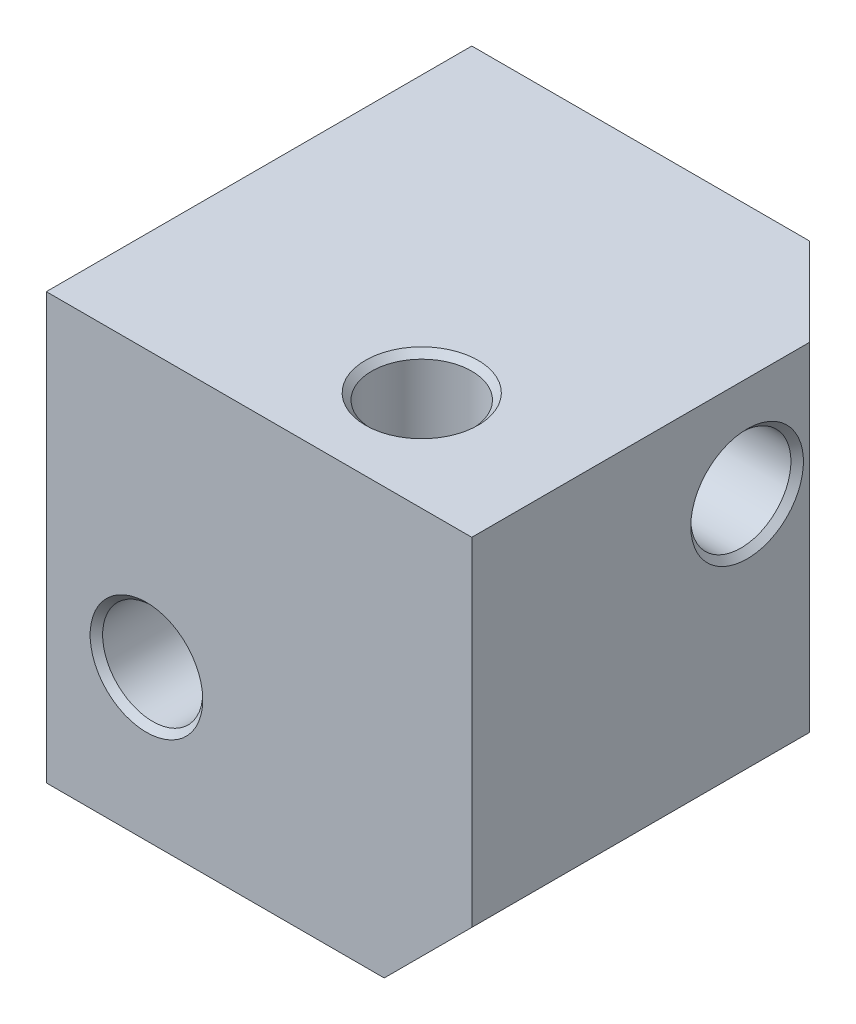
ISO-10303-21;
HEADER;
FILE_DESCRIPTION(('STEP AP214'),'2;1');
FILE_NAME('part.step','',(''),(''),'','','');
FILE_SCHEMA(('AUTOMOTIVE_DESIGN { 1 0 10303 214 1 1 1 1 }'));
ENDSEC;
DATA;
#1=APPLICATION_CONTEXT('core data for automotive mechanical design processes');
#2=APPLICATION_PROTOCOL_DEFINITION('international standard','automotive_design',2000,#1);
#3=PRODUCT_CONTEXT('',#1,'mechanical');
#4=PRODUCT('Part','Part','',(#3));
#5=PRODUCT_RELATED_PRODUCT_CATEGORY('part','',(#4));
#6=PRODUCT_DEFINITION_FORMATION('','',#4);
#7=PRODUCT_DEFINITION_CONTEXT('part definition',#1,'design');
#8=PRODUCT_DEFINITION('design','',#6,#7);
#9=PRODUCT_DEFINITION_SHAPE('','',#8);
#10=(LENGTH_UNIT() NAMED_UNIT(*) SI_UNIT(.MILLI.,.METRE.));
#11=(NAMED_UNIT(*) PLANE_ANGLE_UNIT() SI_UNIT($,.RADIAN.));
#12=(NAMED_UNIT(*) SI_UNIT($,.STERADIAN.) SOLID_ANGLE_UNIT());
#13=UNCERTAINTY_MEASURE_WITH_UNIT(LENGTH_MEASURE(1.E-05),#10,'distance_accuracy_value','');
#14=(GEOMETRIC_REPRESENTATION_CONTEXT(3) GLOBAL_UNCERTAINTY_ASSIGNED_CONTEXT((#13)) GLOBAL_UNIT_ASSIGNED_CONTEXT((#10,
#11,#12)) REPRESENTATION_CONTEXT('',''));
#15=CARTESIAN_POINT('',(0.,0.,0.));
#16=DIRECTION('',(0.,0.,1.));
#17=DIRECTION('',(1.,0.,0.));
#18=AXIS2_PLACEMENT_3D('',#15,#16,#17);
#19=CARTESIAN_POINT('',(0.,0.,17.));
#20=DIRECTION('',(1.,0.,0.));
#21=DIRECTION('',(0.,0.,-1.));
#22=AXIS2_PLACEMENT_3D('',#19,#20,#21);
#23=PLANE('',#22);
#24=CARTESIAN_POINT('',(0.,13.,6.00000000000001));
#25=DIRECTION('',(-1.,0.,0.));
#26=DIRECTION('',(0.,0.,1.));
#27=AXIS2_PLACEMENT_3D('',#24,#25,#26);
#28=CIRCLE('',#27,2.25);
#29=CARTESIAN_POINT('',(0.,13.,8.25000000000001));
#30=VERTEX_POINT('',#29);
#31=EDGE_CURVE('E165',#30,#30,#28,.T.);
#32=ORIENTED_EDGE('',*,*,#31,.F.);
#33=EDGE_LOOP('',(#32));
#34=FACE_BOUND('',#33,.T.);
#35=DIRECTION('',(0.,-1.,0.));
#36=VECTOR('',#35,1.);
#37=CARTESIAN_POINT('',(0.,0.,0.));
#38=LINE('',#37,#36);
#39=CARTESIAN_POINT('',(0.,17.,0.));
#40=VERTEX_POINT('',#39);
#41=CARTESIAN_POINT('',(0.,3.50000000000002,0.));
#42=VERTEX_POINT('',#41);
#43=EDGE_CURVE('E173',#40,#42,#38,.T.);
#44=ORIENTED_EDGE('',*,*,#43,.T.);
#45=DIRECTION('',(0.,-0.707106781186549,0.707106781186546));
#46=VECTOR('',#45,1.);
#47=CARTESIAN_POINT('',(0.,0.,3.5));
#48=LINE('',#47,#46);
#49=CARTESIAN_POINT('',(0.,0.,3.5));
#50=VERTEX_POINT('',#49);
#51=EDGE_CURVE('E11',#42,#50,#48,.T.);
#52=ORIENTED_EDGE('',*,*,#51,.T.);
#53=DIRECTION('',(0.,0.,-1.));
#54=VECTOR('',#53,1.);
#55=CARTESIAN_POINT('',(0.,0.,17.));
#56=LINE('',#55,#54);
#57=CARTESIAN_POINT('',(0.,0.,17.));
#58=VERTEX_POINT('',#57);
#59=EDGE_CURVE('E90',#58,#50,#56,.T.);
#60=ORIENTED_EDGE('',*,*,#59,.F.);
#61=DIRECTION('',(0.,-1.,0.));
#62=VECTOR('',#61,1.);
#63=CARTESIAN_POINT('',(0.,0.,17.));
#64=LINE('',#63,#62);
#65=CARTESIAN_POINT('',(0.,17.,17.));
#66=VERTEX_POINT('',#65);
#67=EDGE_CURVE('E95',#66,#58,#64,.T.);
#68=ORIENTED_EDGE('',*,*,#67,.F.);
#69=DIRECTION('',(0.,0.,-1.));
#70=VECTOR('',#69,1.);
#71=CARTESIAN_POINT('',(0.,17.,17.));
#72=LINE('',#71,#70);
#73=EDGE_CURVE('E111',#66,#40,#72,.T.);
#74=ORIENTED_EDGE('',*,*,#73,.T.);
#75=EDGE_LOOP('',(#44,#52,#60,#68,#74));
#76=FACE_BOUND('',#75,.T.);
#77=ADVANCED_FACE('F31',(#34,#76),#23,.F.);
#78=CARTESIAN_POINT('',(0.,0.,17.));
#79=DIRECTION('',(0.,1.,0.));
#80=DIRECTION('',(0.,0.,1.));
#81=AXIS2_PLACEMENT_3D('',#78,#79,#80);
#82=PLANE('',#81);
#83=CARTESIAN_POINT('',(10.9999999999996,0.,12.9999999999998));
#84=DIRECTION('',(0.,1.,0.));
#85=DIRECTION('',(0.,0.,1.));
#86=AXIS2_PLACEMENT_3D('',#83,#84,#85);
#87=CIRCLE('',#86,2.25);
#88=CARTESIAN_POINT('',(10.9999999999996,0.,15.2499999999998));
#89=VERTEX_POINT('',#88);
#90=EDGE_CURVE('E134',#89,#89,#87,.T.);
#91=ORIENTED_EDGE('',*,*,#90,.T.);
#92=EDGE_LOOP('',(#91));
#93=FACE_BOUND('',#92,.T.);
#94=DIRECTION('',(1.,0.,0.));
#95=VECTOR('',#94,1.);
#96=CARTESIAN_POINT('',(17.,0.,3.5));
#97=LINE('',#96,#95);
#98=CARTESIAN_POINT('',(13.5,0.,3.5));
#99=VERTEX_POINT('',#98);
#100=EDGE_CURVE('E48',#50,#99,#97,.T.);
#101=ORIENTED_EDGE('',*,*,#100,.T.);
#102=DIRECTION('',(0.,0.,1.));
#103=VECTOR('',#102,1.);
#104=CARTESIAN_POINT('',(13.5,0.,17.));
#105=LINE('',#104,#103);
#106=CARTESIAN_POINT('',(13.5,0.,17.));
#107=VERTEX_POINT('',#106);
#108=EDGE_CURVE('E91',#99,#107,#105,.T.);
#109=ORIENTED_EDGE('',*,*,#108,.T.);
#110=DIRECTION('',(1.,0.,0.));
#111=VECTOR('',#110,1.);
#112=CARTESIAN_POINT('',(0.,0.,17.));
#113=LINE('',#112,#111);
#114=EDGE_CURVE('E87',#58,#107,#113,.T.);
#115=ORIENTED_EDGE('',*,*,#114,.F.);
#116=ORIENTED_EDGE('',*,*,#59,.T.);
#117=EDGE_LOOP('',(#101,#109,#115,#116));
#118=FACE_BOUND('',#117,.T.);
#119=ADVANCED_FACE('F89',(#93,#118),#82,.F.);
#120=CARTESIAN_POINT('',(17.,0.,17.));
#121=DIRECTION('',(-1.,0.,0.));
#122=DIRECTION('',(0.,0.,1.));
#123=AXIS2_PLACEMENT_3D('',#120,#121,#122);
#124=PLANE('',#123);
#125=CARTESIAN_POINT('',(17.,13.,6.00000000000001));
#126=DIRECTION('',(-1.,0.,0.));
#127=DIRECTION('',(0.,0.,1.));
#128=AXIS2_PLACEMENT_3D('',#125,#126,#127);
#129=CIRCLE('',#128,2.25);
#130=CARTESIAN_POINT('',(17.,13.,8.25));
#131=VERTEX_POINT('',#130);
#132=EDGE_CURVE('E162',#131,#131,#129,.T.);
#133=ORIENTED_EDGE('',*,*,#132,.T.);
#134=EDGE_LOOP('',(#133));
#135=FACE_BOUND('',#134,.T.);
#136=DIRECTION('',(0.,0.,-1.));
#137=VECTOR('',#136,1.);
#138=CARTESIAN_POINT('',(17.,3.50000000000002,17.));
#139=LINE('',#138,#137);
#140=CARTESIAN_POINT('',(17.,3.50000000000002,17.));
#141=VERTEX_POINT('',#140);
#142=CARTESIAN_POINT('',(17.,3.50000000000002,3.5));
#143=VERTEX_POINT('',#142);
#144=EDGE_CURVE('E105',#141,#143,#139,.T.);
#145=ORIENTED_EDGE('',*,*,#144,.T.);
#146=DIRECTION('',(0.,1.,0.));
#147=VECTOR('',#146,1.);
#148=CARTESIAN_POINT('',(17.,17.,3.5));
#149=LINE('',#148,#147);
#150=CARTESIAN_POINT('',(17.,17.,3.5));
#151=VERTEX_POINT('',#150);
#152=EDGE_CURVE('E108',#143,#151,#149,.T.);
#153=ORIENTED_EDGE('',*,*,#152,.T.);
#154=DIRECTION('',(0.,0.,-1.));
#155=VECTOR('',#154,1.);
#156=CARTESIAN_POINT('',(17.,17.,17.));
#157=LINE('',#156,#155);
#158=CARTESIAN_POINT('',(17.,17.,17.));
#159=VERTEX_POINT('',#158);
#160=EDGE_CURVE('E106',#159,#151,#157,.T.);
#161=ORIENTED_EDGE('',*,*,#160,.F.);
#162=DIRECTION('',(0.,1.,0.));
#163=VECTOR('',#162,1.);
#164=CARTESIAN_POINT('',(17.,0.,17.));
#165=LINE('',#164,#163);
#166=EDGE_CURVE('E94',#141,#159,#165,.T.);
#167=ORIENTED_EDGE('',*,*,#166,.F.);
#168=EDGE_LOOP('',(#145,#153,#161,#167));
#169=FACE_BOUND('',#168,.T.);
#170=ADVANCED_FACE('F204',(#135,#169),#124,.F.);
#171=CARTESIAN_POINT('',(0.,17.,17.));
#172=DIRECTION('',(0.,-1.,0.));
#173=DIRECTION('',(0.,0.,-1.));
#174=AXIS2_PLACEMENT_3D('',#171,#172,#173);
#175=PLANE('',#174);
#176=CARTESIAN_POINT('',(10.9999999999996,17.,12.9999999999998));
#177=DIRECTION('',(0.,1.,0.));
#178=DIRECTION('',(0.,0.,1.));
#179=AXIS2_PLACEMENT_3D('',#176,#177,#178);
#180=CIRCLE('',#179,2.25);
#181=CARTESIAN_POINT('',(10.9999999999996,17.,15.2499999999998));
#182=VERTEX_POINT('',#181);
#183=EDGE_CURVE('E137',#182,#182,#180,.T.);
#184=ORIENTED_EDGE('',*,*,#183,.F.);
#185=EDGE_LOOP('',(#184));
#186=FACE_BOUND('',#185,.T.);
#187=ORIENTED_EDGE('',*,*,#160,.T.);
#188=DIRECTION('',(-0.707106781186549,0.,-0.707106781186546));
#189=VECTOR('',#188,1.);
#190=CARTESIAN_POINT('',(17.,17.,3.5));
#191=LINE('',#190,#189);
#192=CARTESIAN_POINT('',(13.5,17.,0.));
#193=VERTEX_POINT('',#192);
#194=EDGE_CURVE('E117',#151,#193,#191,.T.);
#195=ORIENTED_EDGE('',*,*,#194,.T.);
#196=DIRECTION('',(-1.,0.,0.));
#197=VECTOR('',#196,1.);
#198=CARTESIAN_POINT('',(0.,17.,0.));
#199=LINE('',#198,#197);
#200=EDGE_CURVE('E103',#193,#40,#199,.T.);
#201=ORIENTED_EDGE('',*,*,#200,.T.);
#202=ORIENTED_EDGE('',*,*,#73,.F.);
#203=DIRECTION('',(-1.,0.,0.));
#204=VECTOR('',#203,1.);
#205=CARTESIAN_POINT('',(0.,17.,17.));
#206=LINE('',#205,#204);
#207=EDGE_CURVE('E100',#159,#66,#206,.T.);
#208=ORIENTED_EDGE('',*,*,#207,.F.);
#209=EDGE_LOOP('',(#187,#195,#201,#202,#208));
#210=FACE_BOUND('',#209,.T.);
#211=ADVANCED_FACE('F326',(#186,#210),#175,.F.);
#212=CARTESIAN_POINT('',(0.,17.,17.));
#213=DIRECTION('',(0.,0.,-1.));
#214=DIRECTION('',(-1.,0.,0.));
#215=AXIS2_PLACEMENT_3D('',#212,#213,#214);
#216=PLANE('',#215);
#217=CARTESIAN_POINT('',(4.,6.00000000000001,17.));
#218=DIRECTION('',(0.,0.,1.));
#219=DIRECTION('',(1.,0.,0.));
#220=AXIS2_PLACEMENT_3D('',#217,#218,#219);
#221=CIRCLE('',#220,2.25);
#222=CARTESIAN_POINT('',(6.25,6.00000000000001,17.));
#223=VERTEX_POINT('',#222);
#224=EDGE_CURVE('E153',#223,#223,#221,.T.);
#225=ORIENTED_EDGE('',*,*,#224,.F.);
#226=EDGE_LOOP('',(#225));
#227=FACE_BOUND('',#226,.T.);
#228=ORIENTED_EDGE('',*,*,#114,.T.);
#229=DIRECTION('',(-0.707106781186546,-0.707106781186549,0.));
#230=VECTOR('',#229,1.);
#231=CARTESIAN_POINT('',(17.,3.50000000000002,17.));
#232=LINE('',#231,#230);
#233=EDGE_CURVE('E40',#107,#141,#232,.F.);
#234=ORIENTED_EDGE('',*,*,#233,.T.);
#235=ORIENTED_EDGE('',*,*,#166,.T.);
#236=ORIENTED_EDGE('',*,*,#207,.T.);
#237=ORIENTED_EDGE('',*,*,#67,.T.);
#238=EDGE_LOOP('',(#228,#234,#235,#236,#237));
#239=FACE_BOUND('',#238,.T.);
#240=ADVANCED_FACE('F98',(#227,#239),#216,.F.);
#241=CARTESIAN_POINT('',(0.,17.,0.));
#242=DIRECTION('',(0.,0.,-1.));
#243=DIRECTION('',(-1.,0.,0.));
#244=AXIS2_PLACEMENT_3D('',#241,#242,#243);
#245=PLANE('',#244);
#246=CARTESIAN_POINT('',(4.,6.00000000000001,0.));
#247=DIRECTION('',(0.,0.,1.));
#248=DIRECTION('',(1.,0.,0.));
#249=AXIS2_PLACEMENT_3D('',#246,#247,#248);
#250=CIRCLE('',#249,2.25);
#251=CARTESIAN_POINT('',(6.24999999999999,6.00000000000001,0.));
#252=VERTEX_POINT('',#251);
#253=EDGE_CURVE('E150',#252,#252,#250,.T.);
#254=ORIENTED_EDGE('',*,*,#253,.T.);
#255=EDGE_LOOP('',(#254));
#256=FACE_BOUND('',#255,.T.);
#257=ORIENTED_EDGE('',*,*,#200,.F.);
#258=DIRECTION('',(0.,-1.,0.));
#259=VECTOR('',#258,1.);
#260=CARTESIAN_POINT('',(13.5,0.,0.));
#261=LINE('',#260,#259);
#262=CARTESIAN_POINT('',(13.5,3.50000000000002,0.));
#263=VERTEX_POINT('',#262);
#264=EDGE_CURVE('E121',#193,#263,#261,.T.);
#265=ORIENTED_EDGE('',*,*,#264,.T.);
#266=DIRECTION('',(-1.,0.,0.));
#267=VECTOR('',#266,1.);
#268=CARTESIAN_POINT('',(0.,3.50000000000002,0.));
#269=LINE('',#268,#267);
#270=EDGE_CURVE('E119',#263,#42,#269,.T.);
#271=ORIENTED_EDGE('',*,*,#270,.T.);
#272=ORIENTED_EDGE('',*,*,#43,.F.);
#273=EDGE_LOOP('',(#257,#265,#271,#272));
#274=FACE_BOUND('',#273,.T.);
#275=ADVANCED_FACE('F182',(#256,#274),#245,.T.);
#276=CARTESIAN_POINT('',(16.75,13.,6.00000000000001));
#277=DIRECTION('',(1.,0.,0.));
#278=DIRECTION('',(0.,0.,-1.));
#279=AXIS2_PLACEMENT_3D('',#276,#277,#278);
#280=CONICAL_SURFACE('',#279,2.,0.785398163397441);
#281=ORIENTED_EDGE('',*,*,#132,.F.);
#282=EDGE_LOOP('',(#281));
#283=FACE_BOUND('',#282,.T.);
#284=CARTESIAN_POINT('',(16.75,13.,6.00000000000001));
#285=DIRECTION('',(-1.,0.,0.));
#286=DIRECTION('',(0.,0.,1.));
#287=AXIS2_PLACEMENT_3D('',#284,#285,#286);
#288=CIRCLE('',#287,2.);
#289=CARTESIAN_POINT('',(16.75,13.,8.));
#290=VERTEX_POINT('',#289);
#291=EDGE_CURVE('E171',#290,#290,#288,.T.);
#292=ORIENTED_EDGE('',*,*,#291,.T.);
#293=EDGE_LOOP('',(#292));
#294=FACE_BOUND('',#293,.T.);
#295=ADVANCED_FACE('F302',(#283,#294),#280,.F.);
#296=CARTESIAN_POINT('',(0.,13.,6.00000000000001));
#297=DIRECTION('',(-1.,0.,0.));
#298=DIRECTION('',(0.,0.,1.));
#299=AXIS2_PLACEMENT_3D('',#296,#297,#298);
#300=CYLINDRICAL_SURFACE('',#299,2.);
#301=ORIENTED_EDGE('',*,*,#291,.F.);
#302=EDGE_LOOP('',(#301));
#303=FACE_BOUND('',#302,.T.);
#304=CARTESIAN_POINT('',(0.25,13.,6.00000000000001));
#305=DIRECTION('',(-1.,0.,0.));
#306=DIRECTION('',(0.,0.,1.));
#307=AXIS2_PLACEMENT_3D('',#304,#305,#306);
#308=CIRCLE('',#307,2.);
#309=CARTESIAN_POINT('',(0.25,13.,8.00000000000001));
#310=VERTEX_POINT('',#309);
#311=EDGE_CURVE('E168',#310,#310,#308,.T.);
#312=ORIENTED_EDGE('',*,*,#311,.T.);
#313=EDGE_LOOP('',(#312));
#314=FACE_BOUND('',#313,.T.);
#315=ADVANCED_FACE('F293',(#303,#314),#300,.F.);
#316=CARTESIAN_POINT('',(0.,13.,6.00000000000001));
#317=DIRECTION('',(-1.,0.,0.));
#318=DIRECTION('',(0.,0.,1.));
#319=AXIS2_PLACEMENT_3D('',#316,#317,#318);
#320=CONICAL_SURFACE('',#319,2.25,0.785398163397445);
#321=ORIENTED_EDGE('',*,*,#311,.F.);
#322=EDGE_LOOP('',(#321));
#323=FACE_BOUND('',#322,.T.);
#324=ORIENTED_EDGE('',*,*,#31,.T.);
#325=EDGE_LOOP('',(#324));
#326=FACE_BOUND('',#325,.T.);
#327=ADVANCED_FACE('F284',(#323,#326),#320,.F.);
#328=CARTESIAN_POINT('',(4.,6.00000000000001,0.250000000000004));
#329=DIRECTION('',(0.,0.,-1.));
#330=DIRECTION('',(-1.,0.,0.));
#331=AXIS2_PLACEMENT_3D('',#328,#329,#330);
#332=CONICAL_SURFACE('',#331,2.,0.78539816339744);
#333=ORIENTED_EDGE('',*,*,#253,.F.);
#334=EDGE_LOOP('',(#333));
#335=FACE_BOUND('',#334,.T.);
#336=CARTESIAN_POINT('',(4.,6.00000000000001,0.250000000000004));
#337=DIRECTION('',(0.,0.,1.));
#338=DIRECTION('',(1.,0.,0.));
#339=AXIS2_PLACEMENT_3D('',#336,#337,#338);
#340=CIRCLE('',#339,2.);
#341=CARTESIAN_POINT('',(5.99999999999999,6.00000000000001,0.250000000000004));
#342=VERTEX_POINT('',#341);
#343=EDGE_CURVE('E159',#342,#342,#340,.T.);
#344=ORIENTED_EDGE('',*,*,#343,.T.);
#345=EDGE_LOOP('',(#344));
#346=FACE_BOUND('',#345,.T.);
#347=ADVANCED_FACE('F275',(#335,#346),#332,.F.);
#348=CARTESIAN_POINT('',(4.,6.00000000000001,17.));
#349=DIRECTION('',(0.,0.,1.));
#350=DIRECTION('',(1.,0.,0.));
#351=AXIS2_PLACEMENT_3D('',#348,#349,#350);
#352=CYLINDRICAL_SURFACE('',#351,2.);
#353=ORIENTED_EDGE('',*,*,#343,.F.);
#354=EDGE_LOOP('',(#353));
#355=FACE_BOUND('',#354,.T.);
#356=CARTESIAN_POINT('',(4.,6.00000000000001,16.75));
#357=DIRECTION('',(0.,0.,1.));
#358=DIRECTION('',(1.,0.,0.));
#359=AXIS2_PLACEMENT_3D('',#356,#357,#358);
#360=CIRCLE('',#359,2.);
#361=CARTESIAN_POINT('',(6.,6.00000000000001,16.75));
#362=VERTEX_POINT('',#361);
#363=EDGE_CURVE('E156',#362,#362,#360,.T.);
#364=ORIENTED_EDGE('',*,*,#363,.T.);
#365=EDGE_LOOP('',(#364));
#366=FACE_BOUND('',#365,.T.);
#367=ADVANCED_FACE('F266',(#355,#366),#352,.F.);
#368=CARTESIAN_POINT('',(4.,6.00000000000001,17.));
#369=DIRECTION('',(0.,0.,1.));
#370=DIRECTION('',(1.,0.,0.));
#371=AXIS2_PLACEMENT_3D('',#368,#369,#370);
#372=CONICAL_SURFACE('',#371,2.25,0.78539816339745);
#373=ORIENTED_EDGE('',*,*,#363,.F.);
#374=EDGE_LOOP('',(#373));
#375=FACE_BOUND('',#374,.T.);
#376=ORIENTED_EDGE('',*,*,#224,.T.);
#377=EDGE_LOOP('',(#376));
#378=FACE_BOUND('',#377,.T.);
#379=ADVANCED_FACE('F257',(#375,#378),#372,.F.);
#380=CARTESIAN_POINT('',(10.9999999999996,0.250000000000004,12.9999999999998));
#381=DIRECTION('',(0.,-1.,0.));
#382=DIRECTION('',(0.,0.,-1.));
#383=AXIS2_PLACEMENT_3D('',#380,#381,#382);
#384=CONICAL_SURFACE('',#383,2.,0.785398163397441);
#385=ORIENTED_EDGE('',*,*,#90,.F.);
#386=EDGE_LOOP('',(#385));
#387=FACE_BOUND('',#386,.T.);
#388=CARTESIAN_POINT('',(10.9999999999996,0.250000000000004,12.9999999999998));
#389=DIRECTION('',(0.,1.,0.));
#390=DIRECTION('',(0.,0.,1.));
#391=AXIS2_PLACEMENT_3D('',#388,#389,#390);
#392=CIRCLE('',#391,2.);
#393=CARTESIAN_POINT('',(10.9999999999996,0.250000000000004,14.9999999999998));
#394=VERTEX_POINT('',#393);
#395=EDGE_CURVE('E147',#394,#394,#392,.T.);
#396=ORIENTED_EDGE('',*,*,#395,.T.);
#397=EDGE_LOOP('',(#396));
#398=FACE_BOUND('',#397,.T.);
#399=ADVANCED_FACE('F248',(#387,#398),#384,.F.);
#400=CARTESIAN_POINT('',(10.9999999999996,17.,12.9999999999998));
#401=DIRECTION('',(0.,1.,0.));
#402=DIRECTION('',(0.,0.,1.));
#403=AXIS2_PLACEMENT_3D('',#400,#401,#402);
#404=CYLINDRICAL_SURFACE('',#403,2.);
#405=ORIENTED_EDGE('',*,*,#395,.F.);
#406=EDGE_LOOP('',(#405));
#407=FACE_BOUND('',#406,.T.);
#408=CARTESIAN_POINT('',(10.9999999999996,16.75,12.9999999999998));
#409=DIRECTION('',(0.,1.,0.));
#410=DIRECTION('',(0.,0.,1.));
#411=AXIS2_PLACEMENT_3D('',#408,#409,#410);
#412=CIRCLE('',#411,2.);
#413=CARTESIAN_POINT('',(10.9999999999996,16.75,14.9999999999998));
#414=VERTEX_POINT('',#413);
#415=EDGE_CURVE('E142',#414,#414,#412,.T.);
#416=ORIENTED_EDGE('',*,*,#415,.T.);
#417=EDGE_LOOP('',(#416));
#418=FACE_BOUND('',#417,.T.);
#419=ADVANCED_FACE('F195',(#407,#418),#404,.F.);
#420=CARTESIAN_POINT('',(10.9999999999996,17.,12.9999999999998));
#421=DIRECTION('',(0.,1.,0.));
#422=DIRECTION('',(0.,0.,1.));
#423=AXIS2_PLACEMENT_3D('',#420,#421,#422);
#424=CONICAL_SURFACE('',#423,2.25,0.785398163397448);
#425=ORIENTED_EDGE('',*,*,#415,.F.);
#426=EDGE_LOOP('',(#425));
#427=FACE_BOUND('',#426,.T.);
#428=ORIENTED_EDGE('',*,*,#183,.T.);
#429=EDGE_LOOP('',(#428));
#430=FACE_BOUND('',#429,.T.);
#431=ADVANCED_FACE('F188',(#427,#430),#424,.F.);
#432=CARTESIAN_POINT('',(0.,0.,3.5));
#433=DIRECTION('',(0.,-0.707106781186546,-0.707106781186549));
#434=DIRECTION('',(0.,0.707106781186549,-0.707106781186546));
#435=AXIS2_PLACEMENT_3D('',#432,#433,#434);
#436=PLANE('',#435);
#437=ORIENTED_EDGE('',*,*,#51,.F.);
#438=ORIENTED_EDGE('',*,*,#270,.F.);
#439=DIRECTION('',(0.,0.707106781186549,-0.707106781186546));
#440=VECTOR('',#439,1.);
#441=CARTESIAN_POINT('',(13.5,3.50000000000002,0.));
#442=LINE('',#441,#440);
#443=EDGE_CURVE('E35',#99,#263,#442,.T.);
#444=ORIENTED_EDGE('',*,*,#443,.F.);
#445=ORIENTED_EDGE('',*,*,#100,.F.);
#446=EDGE_LOOP('',(#437,#438,#444,#445));
#447=FACE_BOUND('',#446,.T.);
#448=ADVANCED_FACE('F33',(#447),#436,.T.);
#449=CARTESIAN_POINT('',(17.,3.50000000000002,17.));
#450=DIRECTION('',(-0.707106781186549,0.707106781186546,0.));
#451=DIRECTION('',(-0.707106781186546,-0.707106781186549,0.));
#452=AXIS2_PLACEMENT_3D('',#449,#450,#451);
#453=PLANE('',#452);
#454=ORIENTED_EDGE('',*,*,#233,.F.);
#455=ORIENTED_EDGE('',*,*,#108,.F.);
#456=DIRECTION('',(0.707106781186546,0.707106781186549,0.));
#457=VECTOR('',#456,1.);
#458=CARTESIAN_POINT('',(15.25,1.75000000000001,3.5));
#459=LINE('',#458,#457);
#460=EDGE_CURVE('E128',#143,#99,#459,.F.);
#461=ORIENTED_EDGE('',*,*,#460,.F.);
#462=ORIENTED_EDGE('',*,*,#144,.F.);
#463=EDGE_LOOP('',(#454,#455,#461,#462));
#464=FACE_BOUND('',#463,.T.);
#465=ADVANCED_FACE('F187',(#464),#453,.F.);
#466=CARTESIAN_POINT('',(13.5,3.50000000000002,0.));
#467=DIRECTION('',(0.577350269189626,-0.577350269189623,-0.577350269189628));
#468=DIRECTION('',(-0.707106781186549,0.,-0.707106781186546));
#469=AXIS2_PLACEMENT_3D('',#466,#467,#468);
#470=PLANE('',#469);
#471=ORIENTED_EDGE('',*,*,#460,.T.);
#472=ORIENTED_EDGE('',*,*,#443,.T.);
#473=DIRECTION('',(0.707106781186549,0.,0.707106781186546));
#474=VECTOR('',#473,1.);
#475=CARTESIAN_POINT('',(13.5,3.50000000000002,0.));
#476=LINE('',#475,#474);
#477=EDGE_CURVE('E126',#143,#263,#476,.F.);
#478=ORIENTED_EDGE('',*,*,#477,.F.);
#479=EDGE_LOOP('',(#471,#472,#478));
#480=FACE_BOUND('',#479,.T.);
#481=ADVANCED_FACE('F193',(#480),#470,.T.);
#482=CARTESIAN_POINT('',(17.,0.,3.5));
#483=DIRECTION('',(0.707106781186546,0.,-0.707106781186549));
#484=DIRECTION('',(-0.707106781186549,0.,-0.707106781186546));
#485=AXIS2_PLACEMENT_3D('',#482,#483,#484);
#486=PLANE('',#485);
#487=ORIENTED_EDGE('',*,*,#477,.T.);
#488=ORIENTED_EDGE('',*,*,#264,.F.);
#489=ORIENTED_EDGE('',*,*,#194,.F.);
#490=ORIENTED_EDGE('',*,*,#152,.F.);
#491=EDGE_LOOP('',(#487,#488,#489,#490));
#492=FACE_BOUND('',#491,.T.);
#493=ADVANCED_FACE('F209',(#492),#486,.T.);
#494=CLOSED_SHELL('',(#77,#119,#170,#211,#240,#275,#295,#315,#327,#347,#367,#379,#399,#419,#431,
#448,#465,#481,#493));
#495=MANIFOLD_SOLID_BREP('B2',#494);
#496=ADVANCED_BREP_SHAPE_REPRESENTATION('',(#18,#495),#14);
#497=SHAPE_DEFINITION_REPRESENTATION(#9,#496);
ENDSEC;
END-ISO-10303-21;
